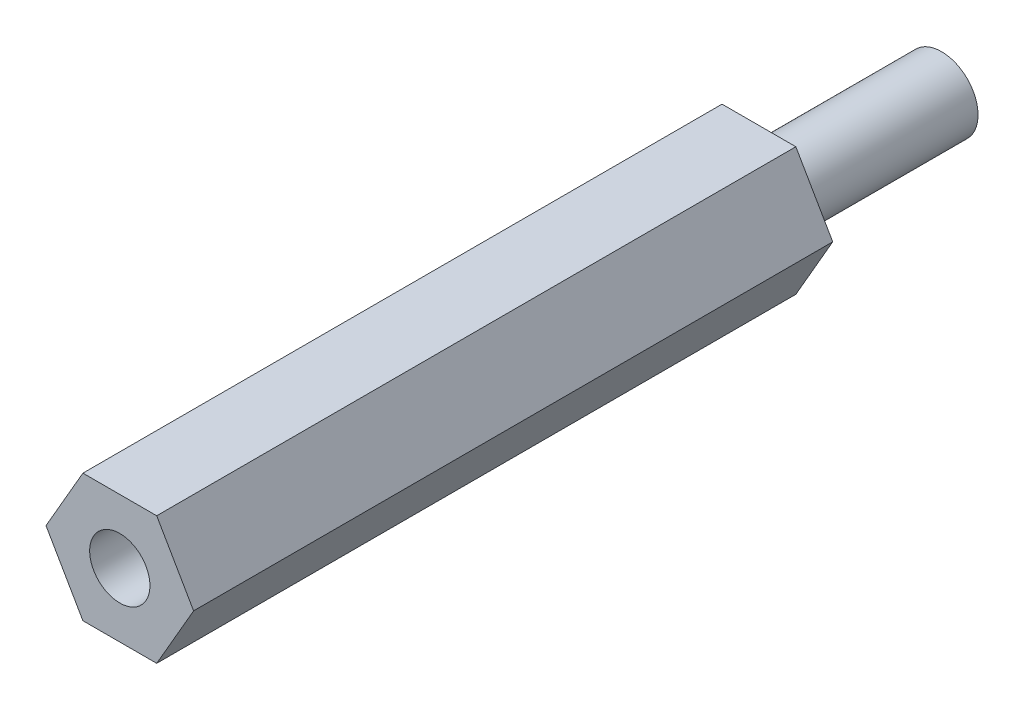
ISO-10303-21;
HEADER;
FILE_DESCRIPTION(('STEP AP214'),'2;1');
FILE_NAME('part.step','',(''),(''),'','','');
FILE_SCHEMA(('AUTOMOTIVE_DESIGN { 1 0 10303 214 1 1 1 1 }'));
ENDSEC;
DATA;
#1=APPLICATION_CONTEXT('core data for automotive mechanical design processes');
#2=APPLICATION_PROTOCOL_DEFINITION('international standard','automotive_design',2000,#1);
#3=PRODUCT_CONTEXT('',#1,'mechanical');
#4=PRODUCT('Part','Part','',(#3));
#5=PRODUCT_RELATED_PRODUCT_CATEGORY('part','',(#4));
#6=PRODUCT_DEFINITION_FORMATION('','',#4);
#7=PRODUCT_DEFINITION_CONTEXT('part definition',#1,'design');
#8=PRODUCT_DEFINITION('design','',#6,#7);
#9=PRODUCT_DEFINITION_SHAPE('','',#8);
#10=(LENGTH_UNIT() NAMED_UNIT(*) SI_UNIT(.MILLI.,.METRE.));
#11=(NAMED_UNIT(*) PLANE_ANGLE_UNIT() SI_UNIT($,.RADIAN.));
#12=(NAMED_UNIT(*) SI_UNIT($,.STERADIAN.) SOLID_ANGLE_UNIT());
#13=UNCERTAINTY_MEASURE_WITH_UNIT(LENGTH_MEASURE(1.E-05),#10,'distance_accuracy_value','');
#14=(GEOMETRIC_REPRESENTATION_CONTEXT(3) GLOBAL_UNCERTAINTY_ASSIGNED_CONTEXT((#13)) GLOBAL_UNIT_ASSIGNED_CONTEXT((#10,
#11,#12)) REPRESENTATION_CONTEXT('',''));
#15=CARTESIAN_POINT('',(0.,0.,0.));
#16=DIRECTION('',(0.,0.,1.));
#17=DIRECTION('',(1.,0.,0.));
#18=AXIS2_PLACEMENT_3D('',#15,#16,#17);
#19=CARTESIAN_POINT('',(2.02072594216369,3.5,35.));
#20=DIRECTION('',(0.,-1.,0.));
#21=DIRECTION('',(1.,0.,0.));
#22=AXIS2_PLACEMENT_3D('',#19,#20,#21);
#23=PLANE('',#22);
#24=DIRECTION('',(-1.,0.,0.));
#25=VECTOR('',#24,1.);
#26=CARTESIAN_POINT('',(2.02072594216369,3.5,0.));
#27=LINE('',#26,#25);
#28=CARTESIAN_POINT('',(2.02072594216369,3.5,0.));
#29=VERTEX_POINT('',#28);
#30=CARTESIAN_POINT('',(-2.02072594216369,3.5,0.));
#31=VERTEX_POINT('',#30);
#32=EDGE_CURVE('E123',#29,#31,#27,.T.);
#33=ORIENTED_EDGE('',*,*,#32,.T.);
#34=DIRECTION('',(0.,0.,-1.));
#35=VECTOR('',#34,1.);
#36=CARTESIAN_POINT('',(-2.02072594216369,3.5,35.));
#37=LINE('',#36,#35);
#38=CARTESIAN_POINT('',(-2.02072594216369,3.5,35.));
#39=VERTEX_POINT('',#38);
#40=EDGE_CURVE('E38',#39,#31,#37,.T.);
#41=ORIENTED_EDGE('',*,*,#40,.F.);
#42=DIRECTION('',(-1.,0.,0.));
#43=VECTOR('',#42,1.);
#44=CARTESIAN_POINT('',(2.02072594216369,3.5,35.));
#45=LINE('',#44,#43);
#46=CARTESIAN_POINT('',(2.02072594216369,3.5,35.));
#47=VERTEX_POINT('',#46);
#48=EDGE_CURVE('E134',#47,#39,#45,.T.);
#49=ORIENTED_EDGE('',*,*,#48,.F.);
#50=DIRECTION('',(0.,0.,-1.));
#51=VECTOR('',#50,1.);
#52=CARTESIAN_POINT('',(2.02072594216369,3.5,35.));
#53=LINE('',#52,#51);
#54=EDGE_CURVE('E119',#47,#29,#53,.T.);
#55=ORIENTED_EDGE('',*,*,#54,.T.);
#56=EDGE_LOOP('',(#33,#41,#49,#55));
#57=FACE_BOUND('',#56,.T.);
#58=ADVANCED_FACE('F35',(#57),#23,.F.);
#59=CARTESIAN_POINT('',(-2.02072594216369,3.5,35.));
#60=DIRECTION('',(0.866025403784439,-0.5,0.));
#61=DIRECTION('',(0.5,0.866025403784439,0.));
#62=AXIS2_PLACEMENT_3D('',#59,#60,#61);
#63=PLANE('',#62);
#64=DIRECTION('',(-0.5,-0.866025403784439,0.));
#65=VECTOR('',#64,1.);
#66=CARTESIAN_POINT('',(-2.02072594216369,3.5,0.));
#67=LINE('',#66,#65);
#68=CARTESIAN_POINT('',(-4.04145188432738,0.,0.));
#69=VERTEX_POINT('',#68);
#70=EDGE_CURVE('E126',#31,#69,#67,.T.);
#71=ORIENTED_EDGE('',*,*,#70,.T.);
#72=DIRECTION('',(0.,0.,-1.));
#73=VECTOR('',#72,1.);
#74=CARTESIAN_POINT('',(-4.04145188432738,0.,35.));
#75=LINE('',#74,#73);
#76=CARTESIAN_POINT('',(-4.04145188432738,0.,35.));
#77=VERTEX_POINT('',#76);
#78=EDGE_CURVE('E137',#77,#69,#75,.T.);
#79=ORIENTED_EDGE('',*,*,#78,.F.);
#80=DIRECTION('',(-0.5,-0.866025403784439,0.));
#81=VECTOR('',#80,1.);
#82=CARTESIAN_POINT('',(-2.02072594216369,3.5,35.));
#83=LINE('',#82,#81);
#84=EDGE_CURVE('E91',#39,#77,#83,.T.);
#85=ORIENTED_EDGE('',*,*,#84,.F.);
#86=ORIENTED_EDGE('',*,*,#40,.T.);
#87=EDGE_LOOP('',(#71,#79,#85,#86));
#88=FACE_BOUND('',#87,.T.);
#89=ADVANCED_FACE('F142',(#88),#63,.F.);
#90=CARTESIAN_POINT('',(-4.04145188432738,0.,35.));
#91=DIRECTION('',(0.866025403784439,0.5,0.));
#92=DIRECTION('',(-0.5,0.866025403784439,0.));
#93=AXIS2_PLACEMENT_3D('',#90,#91,#92);
#94=PLANE('',#93);
#95=DIRECTION('',(0.5,-0.866025403784439,0.));
#96=VECTOR('',#95,1.);
#97=CARTESIAN_POINT('',(-4.04145188432738,0.,0.));
#98=LINE('',#97,#96);
#99=CARTESIAN_POINT('',(-2.02072594216369,-3.5,0.));
#100=VERTEX_POINT('',#99);
#101=EDGE_CURVE('E129',#69,#100,#98,.T.);
#102=ORIENTED_EDGE('',*,*,#101,.T.);
#103=DIRECTION('',(0.,0.,-1.));
#104=VECTOR('',#103,1.);
#105=CARTESIAN_POINT('',(-2.02072594216369,-3.5,35.));
#106=LINE('',#105,#104);
#107=CARTESIAN_POINT('',(-2.02072594216369,-3.5,35.));
#108=VERTEX_POINT('',#107);
#109=EDGE_CURVE('E114',#108,#100,#106,.T.);
#110=ORIENTED_EDGE('',*,*,#109,.F.);
#111=DIRECTION('',(0.5,-0.866025403784439,0.));
#112=VECTOR('',#111,1.);
#113=CARTESIAN_POINT('',(-4.04145188432738,0.,35.));
#114=LINE('',#113,#112);
#115=EDGE_CURVE('E105',#77,#108,#114,.T.);
#116=ORIENTED_EDGE('',*,*,#115,.F.);
#117=ORIENTED_EDGE('',*,*,#78,.T.);
#118=EDGE_LOOP('',(#102,#110,#116,#117));
#119=FACE_BOUND('',#118,.T.);
#120=ADVANCED_FACE('F148',(#119),#94,.F.);
#121=CARTESIAN_POINT('',(-2.02072594216369,-3.5,35.));
#122=DIRECTION('',(0.,1.,0.));
#123=DIRECTION('',(-1.,0.,0.));
#124=AXIS2_PLACEMENT_3D('',#121,#122,#123);
#125=PLANE('',#124);
#126=DIRECTION('',(1.,0.,0.));
#127=VECTOR('',#126,1.);
#128=CARTESIAN_POINT('',(-2.02072594216369,-3.5,0.));
#129=LINE('',#128,#127);
#130=CARTESIAN_POINT('',(2.02072594216369,-3.5,0.));
#131=VERTEX_POINT('',#130);
#132=EDGE_CURVE('E113',#100,#131,#129,.T.);
#133=ORIENTED_EDGE('',*,*,#132,.T.);
#134=DIRECTION('',(0.,0.,-1.));
#135=VECTOR('',#134,1.);
#136=CARTESIAN_POINT('',(2.02072594216369,-3.5,35.));
#137=LINE('',#136,#135);
#138=CARTESIAN_POINT('',(2.02072594216369,-3.5,35.));
#139=VERTEX_POINT('',#138);
#140=EDGE_CURVE('E110',#139,#131,#137,.T.);
#141=ORIENTED_EDGE('',*,*,#140,.F.);
#142=DIRECTION('',(1.,0.,0.));
#143=VECTOR('',#142,1.);
#144=CARTESIAN_POINT('',(-2.02072594216369,-3.5,35.));
#145=LINE('',#144,#143);
#146=EDGE_CURVE('E99',#108,#139,#145,.T.);
#147=ORIENTED_EDGE('',*,*,#146,.F.);
#148=ORIENTED_EDGE('',*,*,#109,.T.);
#149=EDGE_LOOP('',(#133,#141,#147,#148));
#150=FACE_BOUND('',#149,.T.);
#151=ADVANCED_FACE('F111',(#150),#125,.F.);
#152=CARTESIAN_POINT('',(2.02072594216369,-3.5,35.));
#153=DIRECTION('',(-0.866025403784439,0.5,0.));
#154=DIRECTION('',(-0.5,-0.866025403784439,0.));
#155=AXIS2_PLACEMENT_3D('',#152,#153,#154);
#156=PLANE('',#155);
#157=DIRECTION('',(0.5,0.866025403784439,0.));
#158=VECTOR('',#157,1.);
#159=CARTESIAN_POINT('',(2.02072594216369,-3.5,0.));
#160=LINE('',#159,#158);
#161=CARTESIAN_POINT('',(4.04145188432738,0.,0.));
#162=VERTEX_POINT('',#161);
#163=EDGE_CURVE('E76',#131,#162,#160,.T.);
#164=ORIENTED_EDGE('',*,*,#163,.T.);
#165=DIRECTION('',(0.,0.,-1.));
#166=VECTOR('',#165,1.);
#167=CARTESIAN_POINT('',(4.04145188432738,0.,35.));
#168=LINE('',#167,#166);
#169=CARTESIAN_POINT('',(4.04145188432738,0.,35.));
#170=VERTEX_POINT('',#169);
#171=EDGE_CURVE('E115',#170,#162,#168,.T.);
#172=ORIENTED_EDGE('',*,*,#171,.F.);
#173=DIRECTION('',(0.5,0.866025403784439,0.));
#174=VECTOR('',#173,1.);
#175=CARTESIAN_POINT('',(2.02072594216369,-3.5,35.));
#176=LINE('',#175,#174);
#177=EDGE_CURVE('E103',#139,#170,#176,.T.);
#178=ORIENTED_EDGE('',*,*,#177,.F.);
#179=ORIENTED_EDGE('',*,*,#140,.T.);
#180=EDGE_LOOP('',(#164,#172,#178,#179));
#181=FACE_BOUND('',#180,.T.);
#182=ADVANCED_FACE('F117',(#181),#156,.F.);
#183=CARTESIAN_POINT('',(4.04145188432738,0.,35.));
#184=DIRECTION('',(-0.866025403784439,-0.5,0.));
#185=DIRECTION('',(0.5,-0.866025403784439,0.));
#186=AXIS2_PLACEMENT_3D('',#183,#184,#185);
#187=PLANE('',#186);
#188=DIRECTION('',(-0.5,0.866025403784438,0.));
#189=VECTOR('',#188,1.);
#190=CARTESIAN_POINT('',(4.04145188432738,0.,0.));
#191=LINE('',#190,#189);
#192=EDGE_CURVE('E82',#162,#29,#191,.T.);
#193=ORIENTED_EDGE('',*,*,#192,.T.);
#194=ORIENTED_EDGE('',*,*,#54,.F.);
#195=DIRECTION('',(-0.5,0.866025403784438,0.));
#196=VECTOR('',#195,1.);
#197=CARTESIAN_POINT('',(4.04145188432738,0.,35.));
#198=LINE('',#197,#196);
#199=EDGE_CURVE('E52',#170,#47,#198,.T.);
#200=ORIENTED_EDGE('',*,*,#199,.F.);
#201=ORIENTED_EDGE('',*,*,#171,.T.);
#202=EDGE_LOOP('',(#193,#194,#200,#201));
#203=FACE_BOUND('',#202,.T.);
#204=ADVANCED_FACE('F164',(#203),#187,.F.);
#205=CARTESIAN_POINT('',(0.,0.,35.));
#206=DIRECTION('',(0.,0.,1.));
#207=DIRECTION('',(1.,0.,0.));
#208=AXIS2_PLACEMENT_3D('',#205,#206,#207);
#209=PLANE('',#208);
#210=CARTESIAN_POINT('',(0.,0.,35.));
#211=DIRECTION('',(0.,0.,1.));
#212=DIRECTION('',(1.,0.,0.));
#213=AXIS2_PLACEMENT_3D('',#210,#211,#212);
#214=CIRCLE('',#213,1.65);
#215=CARTESIAN_POINT('',(1.65,0.,35.));
#216=VERTEX_POINT('',#215);
#217=EDGE_CURVE('E157',#216,#216,#214,.T.);
#218=ORIENTED_EDGE('',*,*,#217,.F.);
#219=EDGE_LOOP('',(#218));
#220=FACE_BOUND('',#219,.T.);
#221=ORIENTED_EDGE('',*,*,#48,.T.);
#222=ORIENTED_EDGE('',*,*,#84,.T.);
#223=ORIENTED_EDGE('',*,*,#115,.T.);
#224=ORIENTED_EDGE('',*,*,#146,.T.);
#225=ORIENTED_EDGE('',*,*,#177,.T.);
#226=ORIENTED_EDGE('',*,*,#199,.T.);
#227=EDGE_LOOP('',(#221,#222,#223,#224,#225,#226));
#228=FACE_BOUND('',#227,.T.);
#229=ADVANCED_FACE('F101',(#220,#228),#209,.T.);
#230=CARTESIAN_POINT('',(0.,0.,0.));
#231=DIRECTION('',(0.,0.,1.));
#232=DIRECTION('',(1.,0.,0.));
#233=AXIS2_PLACEMENT_3D('',#230,#231,#232);
#234=PLANE('',#233);
#235=CARTESIAN_POINT('',(0.,0.,0.));
#236=DIRECTION('',(0.,0.,-1.));
#237=DIRECTION('',(-1.,0.,0.));
#238=AXIS2_PLACEMENT_3D('',#235,#236,#237);
#239=CIRCLE('',#238,2.);
#240=CARTESIAN_POINT('',(-2.,0.,0.));
#241=VERTEX_POINT('',#240);
#242=EDGE_CURVE('E11',#241,#241,#239,.T.);
#243=ORIENTED_EDGE('',*,*,#242,.F.);
#244=EDGE_LOOP('',(#243));
#245=FACE_BOUND('',#244,.T.);
#246=ORIENTED_EDGE('',*,*,#32,.F.);
#247=ORIENTED_EDGE('',*,*,#192,.F.);
#248=ORIENTED_EDGE('',*,*,#163,.F.);
#249=ORIENTED_EDGE('',*,*,#132,.F.);
#250=ORIENTED_EDGE('',*,*,#101,.F.);
#251=ORIENTED_EDGE('',*,*,#70,.F.);
#252=EDGE_LOOP('',(#246,#247,#248,#249,#250,#251));
#253=FACE_BOUND('',#252,.T.);
#254=ADVANCED_FACE('F147',(#245,#253),#234,.F.);
#255=CARTESIAN_POINT('',(0.,0.,-10.));
#256=DIRECTION('',(0.,0.,1.));
#257=DIRECTION('',(1.,0.,0.));
#258=AXIS2_PLACEMENT_3D('',#255,#256,#257);
#259=CYLINDRICAL_SURFACE('',#258,2.);
#260=CARTESIAN_POINT('',(0.,0.,-10.));
#261=DIRECTION('',(0.,0.,-1.));
#262=DIRECTION('',(-1.,0.,0.));
#263=AXIS2_PLACEMENT_3D('',#260,#261,#262);
#264=CIRCLE('',#263,2.);
#265=CARTESIAN_POINT('',(-2.,0.,-10.));
#266=VERTEX_POINT('',#265);
#267=EDGE_CURVE('E127',#266,#266,#264,.T.);
#268=ORIENTED_EDGE('',*,*,#267,.F.);
#269=EDGE_LOOP('',(#268));
#270=FACE_BOUND('',#269,.T.);
#271=ORIENTED_EDGE('',*,*,#242,.T.);
#272=EDGE_LOOP('',(#271));
#273=FACE_BOUND('',#272,.T.);
#274=ADVANCED_FACE('F170',(#270,#273),#259,.T.);
#275=CARTESIAN_POINT('',(0.,0.,-10.));
#276=DIRECTION('',(0.,0.,-1.));
#277=DIRECTION('',(-1.,0.,0.));
#278=AXIS2_PLACEMENT_3D('',#275,#276,#277);
#279=PLANE('',#278);
#280=ORIENTED_EDGE('',*,*,#267,.T.);
#281=EDGE_LOOP('',(#280));
#282=FACE_BOUND('',#281,.T.);
#283=ADVANCED_FACE('F211',(#282),#279,.T.);
#284=CARTESIAN_POINT('',(0.,0.,24.9));
#285=DIRECTION('',(0.,0.,1.));
#286=DIRECTION('',(1.,0.,0.));
#287=AXIS2_PLACEMENT_3D('',#284,#285,#286);
#288=CONICAL_SURFACE('',#287,1.65,1.02974425867665);
#289=CARTESIAN_POINT('',(0.,0.,23.9085799786045));
#290=VERTEX_POINT('',#289);
#291=VERTEX_LOOP('',#290);
#292=FACE_BOUND('',#291,.T.);
#293=CARTESIAN_POINT('',(0.,0.,24.9));
#294=DIRECTION('',(0.,0.,1.));
#295=DIRECTION('',(1.,0.,0.));
#296=AXIS2_PLACEMENT_3D('',#293,#294,#295);
#297=CIRCLE('',#296,1.65);
#298=CARTESIAN_POINT('',(1.65,0.,24.9));
#299=VERTEX_POINT('',#298);
#300=EDGE_CURVE('E154',#299,#299,#297,.T.);
#301=ORIENTED_EDGE('',*,*,#300,.T.);
#302=EDGE_LOOP('',(#301));
#303=FACE_BOUND('',#302,.T.);
#304=ADVANCED_FACE('F219',(#292,#303),#288,.F.);
#305=CARTESIAN_POINT('',(0.,0.,35.));
#306=DIRECTION('',(0.,0.,1.));
#307=DIRECTION('',(1.,0.,0.));
#308=AXIS2_PLACEMENT_3D('',#305,#306,#307);
#309=CYLINDRICAL_SURFACE('',#308,1.65);
#310=ORIENTED_EDGE('',*,*,#300,.F.);
#311=EDGE_LOOP('',(#310));
#312=FACE_BOUND('',#311,.T.);
#313=ORIENTED_EDGE('',*,*,#217,.T.);
#314=EDGE_LOOP('',(#313));
#315=FACE_BOUND('',#314,.T.);
#316=ADVANCED_FACE('F161',(#312,#315),#309,.F.);
#317=CLOSED_SHELL('',(#58,#89,#120,#151,#182,#204,#229,#254,#274,#283,#304,#316));
#318=MANIFOLD_SOLID_BREP('B2',#317);
#319=ADVANCED_BREP_SHAPE_REPRESENTATION('',(#18,#318),#14);
#320=SHAPE_DEFINITION_REPRESENTATION(#9,#319);
ENDSEC;
END-ISO-10303-21;
